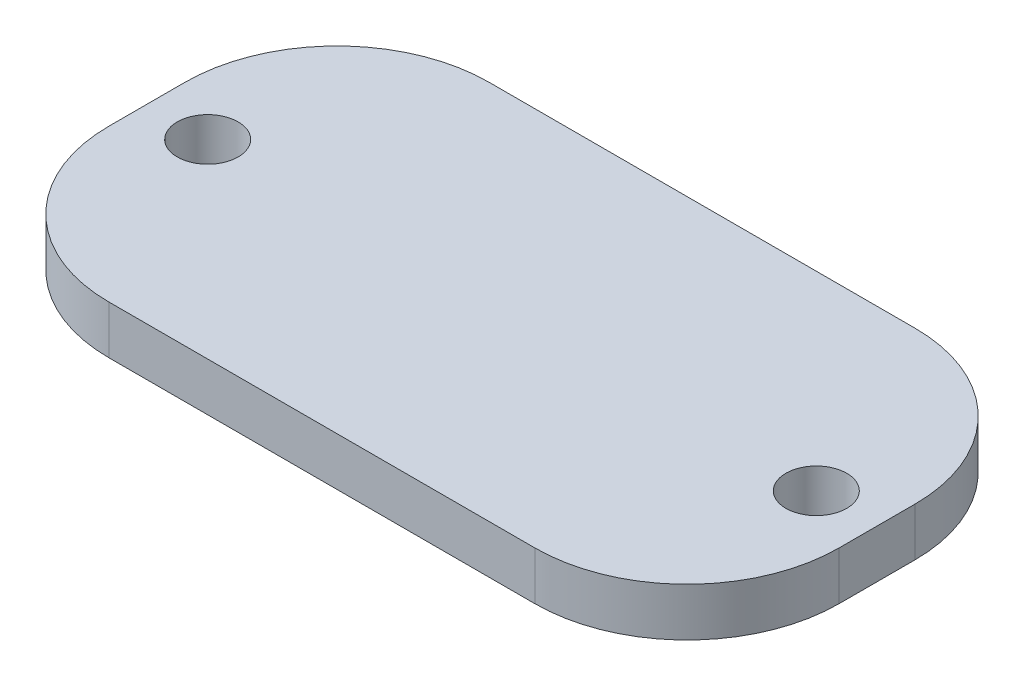
ISO-10303-21;
HEADER;
FILE_DESCRIPTION(('STEP AP214'),'2;1');
FILE_NAME('part.step','',(''),(''),'','','');
FILE_SCHEMA(('AUTOMOTIVE_DESIGN { 1 0 10303 214 1 1 1 1 }'));
ENDSEC;
DATA;
#1=APPLICATION_CONTEXT('core data for automotive mechanical design processes');
#2=APPLICATION_PROTOCOL_DEFINITION('international standard','automotive_design',2000,#1);
#3=PRODUCT_CONTEXT('',#1,'mechanical');
#4=PRODUCT('Part','Part','',(#3));
#5=PRODUCT_RELATED_PRODUCT_CATEGORY('part','',(#4));
#6=PRODUCT_DEFINITION_FORMATION('','',#4);
#7=PRODUCT_DEFINITION_CONTEXT('part definition',#1,'design');
#8=PRODUCT_DEFINITION('design','',#6,#7);
#9=PRODUCT_DEFINITION_SHAPE('','',#8);
#10=(LENGTH_UNIT() NAMED_UNIT(*) SI_UNIT(.MILLI.,.METRE.));
#11=(NAMED_UNIT(*) PLANE_ANGLE_UNIT() SI_UNIT($,.RADIAN.));
#12=(NAMED_UNIT(*) SI_UNIT($,.STERADIAN.) SOLID_ANGLE_UNIT());
#13=UNCERTAINTY_MEASURE_WITH_UNIT(LENGTH_MEASURE(1.E-05),#10,'distance_accuracy_value','');
#14=(GEOMETRIC_REPRESENTATION_CONTEXT(3) GLOBAL_UNCERTAINTY_ASSIGNED_CONTEXT((#13)) GLOBAL_UNIT_ASSIGNED_CONTEXT((#10,
#11,#12)) REPRESENTATION_CONTEXT('',''));
#15=CARTESIAN_POINT('',(0.,0.,0.));
#16=DIRECTION('',(0.,0.,1.));
#17=DIRECTION('',(1.,0.,0.));
#18=AXIS2_PLACEMENT_3D('',#15,#16,#17);
#19=CARTESIAN_POINT('',(0.,3.175,0.));
#20=DIRECTION('',(0.,1.,0.));
#21=DIRECTION('',(0.,0.,1.));
#22=AXIS2_PLACEMENT_3D('',#19,#20,#21);
#23=PLANE('',#22);
#24=CARTESIAN_POINT('',(-20.,3.175,0.));
#25=DIRECTION('',(0.,1.,0.));
#26=DIRECTION('',(0.,0.,1.));
#27=AXIS2_PLACEMENT_3D('',#24,#25,#26);
#28=CIRCLE('',#27,2.);
#29=CARTESIAN_POINT('',(-20.,3.175,2.));
#30=VERTEX_POINT('',#29);
#31=EDGE_CURVE('E164',#30,#30,#28,.T.);
#32=ORIENTED_EDGE('',*,*,#31,.F.);
#33=EDGE_LOOP('',(#32));
#34=FACE_BOUND('',#33,.T.);
#35=DIRECTION('',(0.,0.,1.));
#36=VECTOR('',#35,1.);
#37=CARTESIAN_POINT('',(-24.,3.175,-12.5));
#38=LINE('',#37,#36);
#39=CARTESIAN_POINT('',(-24.,3.175,-2.5));
#40=VERTEX_POINT('',#39);
#41=CARTESIAN_POINT('',(-24.,3.175,2.5));
#42=VERTEX_POINT('',#41);
#43=EDGE_CURVE('E171',#40,#42,#38,.T.);
#44=ORIENTED_EDGE('',*,*,#43,.T.);
#45=CARTESIAN_POINT('',(-14.,3.175,2.5));
#46=DIRECTION('',(0.,1.,0.));
#47=DIRECTION('',(0.,0.,1.));
#48=AXIS2_PLACEMENT_3D('',#45,#46,#47);
#49=CIRCLE('',#48,10.);
#50=CARTESIAN_POINT('',(-14.,3.175,12.5));
#51=VERTEX_POINT('',#50);
#52=EDGE_CURVE('E148',#42,#51,#49,.T.);
#53=ORIENTED_EDGE('',*,*,#52,.T.);
#54=DIRECTION('',(1.,0.,0.));
#55=VECTOR('',#54,1.);
#56=CARTESIAN_POINT('',(-24.,3.175,12.5));
#57=LINE('',#56,#55);
#58=CARTESIAN_POINT('',(14.,3.175,12.5));
#59=VERTEX_POINT('',#58);
#60=EDGE_CURVE('E119',#51,#59,#57,.T.);
#61=ORIENTED_EDGE('',*,*,#60,.T.);
#62=CARTESIAN_POINT('',(14.,3.175,2.5));
#63=DIRECTION('',(0.,1.,0.));
#64=DIRECTION('',(0.,0.,1.));
#65=AXIS2_PLACEMENT_3D('',#62,#63,#64);
#66=CIRCLE('',#65,10.);
#67=CARTESIAN_POINT('',(24.,3.175,2.5));
#68=VERTEX_POINT('',#67);
#69=EDGE_CURVE('E146',#59,#68,#66,.T.);
#70=ORIENTED_EDGE('',*,*,#69,.T.);
#71=DIRECTION('',(0.,0.,-1.));
#72=VECTOR('',#71,1.);
#73=CARTESIAN_POINT('',(24.,3.175,-12.5));
#74=LINE('',#73,#72);
#75=CARTESIAN_POINT('',(24.,3.175,-2.50000000000001));
#76=VERTEX_POINT('',#75);
#77=EDGE_CURVE('E126',#68,#76,#74,.T.);
#78=ORIENTED_EDGE('',*,*,#77,.T.);
#79=CARTESIAN_POINT('',(14.,3.175,-2.5));
#80=DIRECTION('',(0.,1.,0.));
#81=DIRECTION('',(0.,0.,1.));
#82=AXIS2_PLACEMENT_3D('',#79,#80,#81);
#83=CIRCLE('',#82,10.);
#84=CARTESIAN_POINT('',(14.,3.175,-12.5));
#85=VERTEX_POINT('',#84);
#86=EDGE_CURVE('E54',#76,#85,#83,.T.);
#87=ORIENTED_EDGE('',*,*,#86,.T.);
#88=DIRECTION('',(-1.,0.,0.));
#89=VECTOR('',#88,1.);
#90=CARTESIAN_POINT('',(-24.,3.175,-12.5));
#91=LINE('',#90,#89);
#92=CARTESIAN_POINT('',(-14.,3.175,-12.5));
#93=VERTEX_POINT('',#92);
#94=EDGE_CURVE('E129',#85,#93,#91,.T.);
#95=ORIENTED_EDGE('',*,*,#94,.T.);
#96=CARTESIAN_POINT('',(-14.,3.175,-2.5));
#97=DIRECTION('',(0.,1.,0.));
#98=DIRECTION('',(0.,0.,1.));
#99=AXIS2_PLACEMENT_3D('',#96,#97,#98);
#100=CIRCLE('',#99,10.);
#101=EDGE_CURVE('E143',#93,#40,#100,.T.);
#102=ORIENTED_EDGE('',*,*,#101,.T.);
#103=EDGE_LOOP('',(#44,#53,#61,#70,#78,#87,#95,#102));
#104=FACE_BOUND('',#103,.T.);
#105=CARTESIAN_POINT('',(20.,3.175,0.));
#106=DIRECTION('',(0.,1.,0.));
#107=DIRECTION('',(0.,0.,1.));
#108=AXIS2_PLACEMENT_3D('',#105,#106,#107);
#109=CIRCLE('',#108,2.);
#110=CARTESIAN_POINT('',(20.,3.175,2.));
#111=VERTEX_POINT('',#110);
#112=EDGE_CURVE('E176',#111,#111,#109,.T.);
#113=ORIENTED_EDGE('',*,*,#112,.F.);
#114=EDGE_LOOP('',(#113));
#115=FACE_BOUND('',#114,.T.);
#116=ADVANCED_FACE('F33',(#34,#104,#115),#23,.T.);
#117=CARTESIAN_POINT('',(0.,0.,0.));
#118=DIRECTION('',(0.,1.,0.));
#119=DIRECTION('',(0.,0.,1.));
#120=AXIS2_PLACEMENT_3D('',#117,#118,#119);
#121=PLANE('',#120);
#122=DIRECTION('',(1.,0.,0.));
#123=VECTOR('',#122,1.);
#124=CARTESIAN_POINT('',(-24.,0.,12.5));
#125=LINE('',#124,#123);
#126=CARTESIAN_POINT('',(-14.,0.,12.5));
#127=VERTEX_POINT('',#126);
#128=CARTESIAN_POINT('',(14.,0.,12.5));
#129=VERTEX_POINT('',#128);
#130=EDGE_CURVE('E116',#127,#129,#125,.T.);
#131=ORIENTED_EDGE('',*,*,#130,.F.);
#132=CARTESIAN_POINT('',(-14.,0.,2.5));
#133=DIRECTION('',(0.,1.,0.));
#134=DIRECTION('',(0.,0.,1.));
#135=AXIS2_PLACEMENT_3D('',#132,#133,#134);
#136=CIRCLE('',#135,10.);
#137=CARTESIAN_POINT('',(-24.,0.,2.5));
#138=VERTEX_POINT('',#137);
#139=EDGE_CURVE('E99',#127,#138,#136,.F.);
#140=ORIENTED_EDGE('',*,*,#139,.T.);
#141=DIRECTION('',(0.,0.,1.));
#142=VECTOR('',#141,1.);
#143=CARTESIAN_POINT('',(-24.,0.,-12.5));
#144=LINE('',#143,#142);
#145=CARTESIAN_POINT('',(-24.,0.,-2.5));
#146=VERTEX_POINT('',#145);
#147=EDGE_CURVE('E127',#146,#138,#144,.T.);
#148=ORIENTED_EDGE('',*,*,#147,.F.);
#149=CARTESIAN_POINT('',(-14.,0.,-2.5));
#150=DIRECTION('',(0.,1.,0.));
#151=DIRECTION('',(0.,0.,1.));
#152=AXIS2_PLACEMENT_3D('',#149,#150,#151);
#153=CIRCLE('',#152,10.);
#154=CARTESIAN_POINT('',(-14.,0.,-12.5));
#155=VERTEX_POINT('',#154);
#156=EDGE_CURVE('E120',#146,#155,#153,.F.);
#157=ORIENTED_EDGE('',*,*,#156,.T.);
#158=DIRECTION('',(-1.,0.,0.));
#159=VECTOR('',#158,1.);
#160=CARTESIAN_POINT('',(-24.,0.,-12.5));
#161=LINE('',#160,#159);
#162=CARTESIAN_POINT('',(14.,0.,-12.5));
#163=VERTEX_POINT('',#162);
#164=EDGE_CURVE('E131',#163,#155,#161,.T.);
#165=ORIENTED_EDGE('',*,*,#164,.F.);
#166=CARTESIAN_POINT('',(14.,0.,-2.5));
#167=DIRECTION('',(0.,1.,0.));
#168=DIRECTION('',(0.,0.,1.));
#169=AXIS2_PLACEMENT_3D('',#166,#167,#168);
#170=CIRCLE('',#169,10.);
#171=CARTESIAN_POINT('',(24.,0.,-2.50000000000001));
#172=VERTEX_POINT('',#171);
#173=EDGE_CURVE('E137',#163,#172,#170,.F.);
#174=ORIENTED_EDGE('',*,*,#173,.T.);
#175=DIRECTION('',(0.,0.,-1.));
#176=VECTOR('',#175,1.);
#177=CARTESIAN_POINT('',(24.,0.,-12.5));
#178=LINE('',#177,#176);
#179=CARTESIAN_POINT('',(24.,0.,2.5));
#180=VERTEX_POINT('',#179);
#181=EDGE_CURVE('E159',#180,#172,#178,.T.);
#182=ORIENTED_EDGE('',*,*,#181,.F.);
#183=CARTESIAN_POINT('',(14.,0.,2.5));
#184=DIRECTION('',(0.,1.,0.));
#185=DIRECTION('',(0.,0.,1.));
#186=AXIS2_PLACEMENT_3D('',#183,#184,#185);
#187=CIRCLE('',#186,10.);
#188=EDGE_CURVE('E110',#180,#129,#187,.F.);
#189=ORIENTED_EDGE('',*,*,#188,.T.);
#190=EDGE_LOOP('',(#131,#140,#148,#157,#165,#174,#182,#189));
#191=FACE_BOUND('',#190,.T.);
#192=CARTESIAN_POINT('',(-20.,0.,0.));
#193=DIRECTION('',(0.,1.,0.));
#194=DIRECTION('',(0.,0.,1.));
#195=AXIS2_PLACEMENT_3D('',#192,#193,#194);
#196=CIRCLE('',#195,2.);
#197=CARTESIAN_POINT('',(-20.,0.,2.));
#198=VERTEX_POINT('',#197);
#199=EDGE_CURVE('E167',#198,#198,#196,.T.);
#200=ORIENTED_EDGE('',*,*,#199,.T.);
#201=EDGE_LOOP('',(#200));
#202=FACE_BOUND('',#201,.T.);
#203=CARTESIAN_POINT('',(20.,0.,0.));
#204=DIRECTION('',(0.,1.,0.));
#205=DIRECTION('',(0.,0.,1.));
#206=AXIS2_PLACEMENT_3D('',#203,#204,#205);
#207=CIRCLE('',#206,2.);
#208=CARTESIAN_POINT('',(20.,0.,2.));
#209=VERTEX_POINT('',#208);
#210=EDGE_CURVE('E178',#209,#209,#207,.T.);
#211=ORIENTED_EDGE('',*,*,#210,.T.);
#212=EDGE_LOOP('',(#211));
#213=FACE_BOUND('',#212,.T.);
#214=ADVANCED_FACE('F123',(#191,#202,#213),#121,.F.);
#215=CARTESIAN_POINT('',(24.,3.175,-12.5));
#216=DIRECTION('',(-1.,0.,0.));
#217=DIRECTION('',(0.,0.,1.));
#218=AXIS2_PLACEMENT_3D('',#215,#216,#217);
#219=PLANE('',#218);
#220=ORIENTED_EDGE('',*,*,#77,.F.);
#221=DIRECTION('',(0.,-1.,0.));
#222=VECTOR('',#221,1.);
#223=CARTESIAN_POINT('',(24.,3.175,2.5));
#224=LINE('',#223,#222);
#225=EDGE_CURVE('E152',#68,#180,#224,.T.);
#226=ORIENTED_EDGE('',*,*,#225,.T.);
#227=ORIENTED_EDGE('',*,*,#181,.T.);
#228=DIRECTION('',(0.,-1.,0.));
#229=VECTOR('',#228,1.);
#230=CARTESIAN_POINT('',(24.,3.175,-2.50000000000001));
#231=LINE('',#230,#229);
#232=EDGE_CURVE('E150',#172,#76,#231,.F.);
#233=ORIENTED_EDGE('',*,*,#232,.T.);
#234=EDGE_LOOP('',(#220,#226,#227,#233));
#235=FACE_BOUND('',#234,.T.);
#236=ADVANCED_FACE('F158',(#235),#219,.F.);
#237=CARTESIAN_POINT('',(-24.,3.175,-12.5));
#238=DIRECTION('',(0.,0.,1.));
#239=DIRECTION('',(1.,0.,0.));
#240=AXIS2_PLACEMENT_3D('',#237,#238,#239);
#241=PLANE('',#240);
#242=ORIENTED_EDGE('',*,*,#94,.F.);
#243=DIRECTION('',(0.,-1.,0.));
#244=VECTOR('',#243,1.);
#245=CARTESIAN_POINT('',(14.,3.175,-12.5));
#246=LINE('',#245,#244);
#247=EDGE_CURVE('E11',#85,#163,#246,.T.);
#248=ORIENTED_EDGE('',*,*,#247,.T.);
#249=ORIENTED_EDGE('',*,*,#164,.T.);
#250=DIRECTION('',(0.,-1.,0.));
#251=VECTOR('',#250,1.);
#252=CARTESIAN_POINT('',(-14.,3.175,-12.5));
#253=LINE('',#252,#251);
#254=EDGE_CURVE('E41',#155,#93,#253,.F.);
#255=ORIENTED_EDGE('',*,*,#254,.T.);
#256=EDGE_LOOP('',(#242,#248,#249,#255));
#257=FACE_BOUND('',#256,.T.);
#258=ADVANCED_FACE('F204',(#257),#241,.F.);
#259=CARTESIAN_POINT('',(-24.,3.175,-12.5));
#260=DIRECTION('',(1.,0.,0.));
#261=DIRECTION('',(0.,0.,-1.));
#262=AXIS2_PLACEMENT_3D('',#259,#260,#261);
#263=PLANE('',#262);
#264=ORIENTED_EDGE('',*,*,#147,.T.);
#265=DIRECTION('',(0.,-1.,0.));
#266=VECTOR('',#265,1.);
#267=CARTESIAN_POINT('',(-24.,3.175,2.5));
#268=LINE('',#267,#266);
#269=EDGE_CURVE('E104',#138,#42,#268,.F.);
#270=ORIENTED_EDGE('',*,*,#269,.T.);
#271=ORIENTED_EDGE('',*,*,#43,.F.);
#272=DIRECTION('',(0.,-1.,0.));
#273=VECTOR('',#272,1.);
#274=CARTESIAN_POINT('',(-24.,3.175,-2.5));
#275=LINE('',#274,#273);
#276=EDGE_CURVE('E109',#40,#146,#275,.T.);
#277=ORIENTED_EDGE('',*,*,#276,.T.);
#278=EDGE_LOOP('',(#264,#270,#271,#277));
#279=FACE_BOUND('',#278,.T.);
#280=ADVANCED_FACE('F201',(#279),#263,.F.);
#281=CARTESIAN_POINT('',(-24.,3.175,12.5));
#282=DIRECTION('',(0.,0.,-1.));
#283=DIRECTION('',(-1.,0.,0.));
#284=AXIS2_PLACEMENT_3D('',#281,#282,#283);
#285=PLANE('',#284);
#286=ORIENTED_EDGE('',*,*,#60,.F.);
#287=DIRECTION('',(0.,-1.,0.));
#288=VECTOR('',#287,1.);
#289=CARTESIAN_POINT('',(-14.,3.175,12.5));
#290=LINE('',#289,#288);
#291=EDGE_CURVE('E103',#51,#127,#290,.T.);
#292=ORIENTED_EDGE('',*,*,#291,.T.);
#293=ORIENTED_EDGE('',*,*,#130,.T.);
#294=DIRECTION('',(0.,-1.,0.));
#295=VECTOR('',#294,1.);
#296=CARTESIAN_POINT('',(14.,3.175,12.5));
#297=LINE('',#296,#295);
#298=EDGE_CURVE('E121',#129,#59,#297,.F.);
#299=ORIENTED_EDGE('',*,*,#298,.T.);
#300=EDGE_LOOP('',(#286,#292,#293,#299));
#301=FACE_BOUND('',#300,.T.);
#302=ADVANCED_FACE('F115',(#301),#285,.F.);
#303=CARTESIAN_POINT('',(-20.,3.175,0.));
#304=DIRECTION('',(0.,-1.,0.));
#305=DIRECTION('',(0.,0.,-1.));
#306=AXIS2_PLACEMENT_3D('',#303,#304,#305);
#307=CYLINDRICAL_SURFACE('',#306,2.);
#308=ORIENTED_EDGE('',*,*,#31,.T.);
#309=EDGE_LOOP('',(#308));
#310=FACE_BOUND('',#309,.T.);
#311=ORIENTED_EDGE('',*,*,#199,.F.);
#312=EDGE_LOOP('',(#311));
#313=FACE_BOUND('',#312,.T.);
#314=ADVANCED_FACE('F196',(#310,#313),#307,.F.);
#315=CARTESIAN_POINT('',(20.,3.175,0.));
#316=DIRECTION('',(0.,-1.,0.));
#317=DIRECTION('',(0.,0.,-1.));
#318=AXIS2_PLACEMENT_3D('',#315,#316,#317);
#319=CYLINDRICAL_SURFACE('',#318,2.);
#320=ORIENTED_EDGE('',*,*,#112,.T.);
#321=EDGE_LOOP('',(#320));
#322=FACE_BOUND('',#321,.T.);
#323=ORIENTED_EDGE('',*,*,#210,.F.);
#324=EDGE_LOOP('',(#323));
#325=FACE_BOUND('',#324,.T.);
#326=ADVANCED_FACE('F184',(#322,#325),#319,.F.);
#327=CARTESIAN_POINT('',(-14.,3.175,2.5));
#328=DIRECTION('',(0.,-1.,0.));
#329=DIRECTION('',(0.,0.,-1.));
#330=AXIS2_PLACEMENT_3D('',#327,#328,#329);
#331=CYLINDRICAL_SURFACE('',#330,10.);
#332=ORIENTED_EDGE('',*,*,#52,.F.);
#333=ORIENTED_EDGE('',*,*,#269,.F.);
#334=ORIENTED_EDGE('',*,*,#139,.F.);
#335=ORIENTED_EDGE('',*,*,#291,.F.);
#336=EDGE_LOOP('',(#332,#333,#334,#335));
#337=FACE_BOUND('',#336,.T.);
#338=ADVANCED_FACE('F102',(#337),#331,.T.);
#339=CARTESIAN_POINT('',(14.,3.175,2.5));
#340=DIRECTION('',(0.,-1.,0.));
#341=DIRECTION('',(0.,0.,-1.));
#342=AXIS2_PLACEMENT_3D('',#339,#340,#341);
#343=CYLINDRICAL_SURFACE('',#342,10.);
#344=ORIENTED_EDGE('',*,*,#69,.F.);
#345=ORIENTED_EDGE('',*,*,#298,.F.);
#346=ORIENTED_EDGE('',*,*,#188,.F.);
#347=ORIENTED_EDGE('',*,*,#225,.F.);
#348=EDGE_LOOP('',(#344,#345,#346,#347));
#349=FACE_BOUND('',#348,.T.);
#350=ADVANCED_FACE('F212',(#349),#343,.T.);
#351=CARTESIAN_POINT('',(14.,3.175,-2.5));
#352=DIRECTION('',(0.,-1.,0.));
#353=DIRECTION('',(0.,0.,-1.));
#354=AXIS2_PLACEMENT_3D('',#351,#352,#353);
#355=CYLINDRICAL_SURFACE('',#354,10.);
#356=ORIENTED_EDGE('',*,*,#86,.F.);
#357=ORIENTED_EDGE('',*,*,#232,.F.);
#358=ORIENTED_EDGE('',*,*,#173,.F.);
#359=ORIENTED_EDGE('',*,*,#247,.F.);
#360=EDGE_LOOP('',(#356,#357,#358,#359));
#361=FACE_BOUND('',#360,.T.);
#362=ADVANCED_FACE('F214',(#361),#355,.T.);
#363=CARTESIAN_POINT('',(-14.,3.175,-2.5));
#364=DIRECTION('',(0.,-1.,0.));
#365=DIRECTION('',(0.,0.,-1.));
#366=AXIS2_PLACEMENT_3D('',#363,#364,#365);
#367=CYLINDRICAL_SURFACE('',#366,10.);
#368=ORIENTED_EDGE('',*,*,#101,.F.);
#369=ORIENTED_EDGE('',*,*,#254,.F.);
#370=ORIENTED_EDGE('',*,*,#156,.F.);
#371=ORIENTED_EDGE('',*,*,#276,.F.);
#372=EDGE_LOOP('',(#368,#369,#370,#371));
#373=FACE_BOUND('',#372,.T.);
#374=ADVANCED_FACE('F35',(#373),#367,.T.);
#375=CLOSED_SHELL('',(#116,#214,#236,#258,#280,#302,#314,#326,#338,#350,#362,#374));
#376=MANIFOLD_SOLID_BREP('B2',#375);
#377=ADVANCED_BREP_SHAPE_REPRESENTATION('',(#18,#376),#14);
#378=SHAPE_DEFINITION_REPRESENTATION(#9,#377);
ENDSEC;
END-ISO-10303-21;
